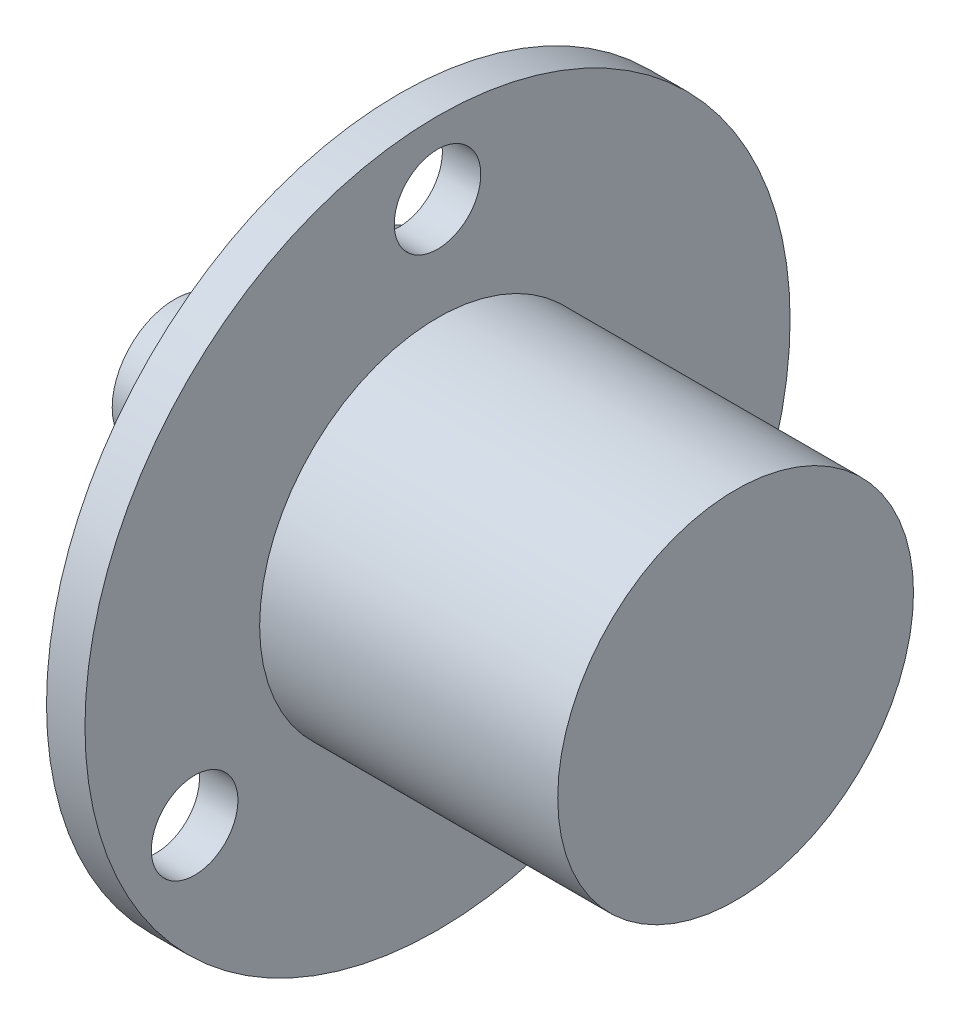
ISO-10303-21;
HEADER;
FILE_DESCRIPTION(('STEP AP214'),'2;1');
FILE_NAME('part.step','',(''),(''),'','','');
FILE_SCHEMA(('AUTOMOTIVE_DESIGN { 1 0 10303 214 1 1 1 1 }'));
ENDSEC;
DATA;
#1=APPLICATION_CONTEXT('core data for automotive mechanical design processes');
#2=APPLICATION_PROTOCOL_DEFINITION('international standard','automotive_design',2000,#1);
#3=PRODUCT_CONTEXT('',#1,'mechanical');
#4=PRODUCT('Part','Part','',(#3));
#5=PRODUCT_RELATED_PRODUCT_CATEGORY('part','',(#4));
#6=PRODUCT_DEFINITION_FORMATION('','',#4);
#7=PRODUCT_DEFINITION_CONTEXT('part definition',#1,'design');
#8=PRODUCT_DEFINITION('design','',#6,#7);
#9=PRODUCT_DEFINITION_SHAPE('','',#8);
#10=(LENGTH_UNIT() NAMED_UNIT(*) SI_UNIT(.MILLI.,.METRE.));
#11=(NAMED_UNIT(*) PLANE_ANGLE_UNIT() SI_UNIT($,.RADIAN.));
#12=(NAMED_UNIT(*) SI_UNIT($,.STERADIAN.) SOLID_ANGLE_UNIT());
#13=UNCERTAINTY_MEASURE_WITH_UNIT(LENGTH_MEASURE(1.E-05),#10,'distance_accuracy_value','');
#14=(GEOMETRIC_REPRESENTATION_CONTEXT(3) GLOBAL_UNCERTAINTY_ASSIGNED_CONTEXT((#13)) GLOBAL_UNIT_ASSIGNED_CONTEXT((#10,
#11,#12)) REPRESENTATION_CONTEXT('',''));
#15=CARTESIAN_POINT('',(0.,0.,0.));
#16=DIRECTION('',(0.,0.,1.));
#17=DIRECTION('',(1.,0.,0.));
#18=AXIS2_PLACEMENT_3D('',#15,#16,#17);
#19=CARTESIAN_POINT('',(0.,3.9,0.));
#20=DIRECTION('',(1.,0.,0.));
#21=DIRECTION('',(0.,0.,-1.));
#22=AXIS2_PLACEMENT_3D('',#19,#20,#21);
#23=PLANE('',#22);
#24=CARTESIAN_POINT('',(0.,0.,0.));
#25=DIRECTION('',(-1.,0.,0.));
#26=DIRECTION('',(0.,0.,1.));
#27=AXIS2_PLACEMENT_3D('',#24,#25,#26);
#28=CIRCLE('',#27,3.9);
#29=CARTESIAN_POINT('',(0.,0.,3.9));
#30=VERTEX_POINT('',#29);
#31=EDGE_CURVE('E59',#30,#30,#28,.T.);
#32=ORIENTED_EDGE('',*,*,#31,.T.);
#33=EDGE_LOOP('',(#32));
#34=FACE_BOUND('',#33,.T.);
#35=ADVANCED_FACE('F31',(#34),#23,.F.);
#36=CARTESIAN_POINT('',(35.,0.,0.));
#37=DIRECTION('',(-1.,0.,0.));
#38=DIRECTION('',(0.,0.,1.));
#39=AXIS2_PLACEMENT_3D('',#36,#37,#38);
#40=PLANE('',#39);
#41=CARTESIAN_POINT('',(35.,0.,0.));
#42=DIRECTION('',(-1.,0.,0.));
#43=DIRECTION('',(0.,0.,1.));
#44=AXIS2_PLACEMENT_3D('',#41,#42,#43);
#45=CIRCLE('',#44,11.1);
#46=CARTESIAN_POINT('',(35.,0.,11.1));
#47=VERTEX_POINT('',#46);
#48=EDGE_CURVE('E10',#47,#47,#45,.T.);
#49=ORIENTED_EDGE('',*,*,#48,.F.);
#50=EDGE_LOOP('',(#49));
#51=FACE_BOUND('',#50,.T.);
#52=ADVANCED_FACE('F111',(#51),#40,.F.);
#53=CARTESIAN_POINT('',(0.,0.,0.));
#54=DIRECTION('',(-1.,0.,0.));
#55=DIRECTION('',(0.,0.,1.));
#56=AXIS2_PLACEMENT_3D('',#53,#54,#55);
#57=CYLINDRICAL_SURFACE('',#56,11.1);
#58=CARTESIAN_POINT('',(16.4,0.,0.));
#59=DIRECTION('',(-1.,0.,0.));
#60=DIRECTION('',(0.,0.,1.));
#61=AXIS2_PLACEMENT_3D('',#58,#59,#60);
#62=CIRCLE('',#61,11.1);
#63=CARTESIAN_POINT('',(16.4,0.,11.1));
#64=VERTEX_POINT('',#63);
#65=EDGE_CURVE('E37',#64,#64,#62,.T.);
#66=ORIENTED_EDGE('',*,*,#65,.F.);
#67=EDGE_LOOP('',(#66));
#68=FACE_BOUND('',#67,.T.);
#69=ORIENTED_EDGE('',*,*,#48,.T.);
#70=EDGE_LOOP('',(#69));
#71=FACE_BOUND('',#70,.T.);
#72=ADVANCED_FACE('F105',(#68,#71),#57,.T.);
#73=CARTESIAN_POINT('',(16.4,11.1,0.));
#74=DIRECTION('',(-1.,0.,0.));
#75=DIRECTION('',(0.,0.,1.));
#76=AXIS2_PLACEMENT_3D('',#73,#74,#75);
#77=PLANE('',#76);
#78=CARTESIAN_POINT('',(16.4,17.5,0.));
#79=DIRECTION('',(-1.,0.,0.));
#80=DIRECTION('',(0.,0.,1.));
#81=AXIS2_PLACEMENT_3D('',#78,#79,#80);
#82=CIRCLE('',#81,2.7);
#83=CARTESIAN_POINT('',(16.4,17.5,2.7));
#84=VERTEX_POINT('',#83);
#85=EDGE_CURVE('E62',#84,#84,#82,.T.);
#86=ORIENTED_EDGE('',*,*,#85,.T.);
#87=EDGE_LOOP('',(#86));
#88=FACE_BOUND('',#87,.T.);
#89=CARTESIAN_POINT('',(16.4,-8.75,15.1554445662277));
#90=DIRECTION('',(-1.,0.,0.));
#91=DIRECTION('',(0.,0.,1.));
#92=AXIS2_PLACEMENT_3D('',#89,#90,#91);
#93=CIRCLE('',#92,2.7);
#94=CARTESIAN_POINT('',(16.4,-8.75,17.8554445662277));
#95=VERTEX_POINT('',#94);
#96=EDGE_CURVE('E65',#95,#95,#93,.T.);
#97=ORIENTED_EDGE('',*,*,#96,.T.);
#98=EDGE_LOOP('',(#97));
#99=FACE_BOUND('',#98,.T.);
#100=CARTESIAN_POINT('',(16.4,-8.75000000000001,-15.1554445662277));
#101=DIRECTION('',(-1.,0.,0.));
#102=DIRECTION('',(0.,0.,1.));
#103=AXIS2_PLACEMENT_3D('',#100,#101,#102);
#104=CIRCLE('',#103,2.7);
#105=CARTESIAN_POINT('',(16.4,-8.75000000000001,-12.4554445662277));
#106=VERTEX_POINT('',#105);
#107=EDGE_CURVE('E68',#106,#106,#104,.T.);
#108=ORIENTED_EDGE('',*,*,#107,.T.);
#109=EDGE_LOOP('',(#108));
#110=FACE_BOUND('',#109,.T.);
#111=CARTESIAN_POINT('',(16.4,0.,0.));
#112=DIRECTION('',(-1.,0.,0.));
#113=DIRECTION('',(0.,0.,1.));
#114=AXIS2_PLACEMENT_3D('',#111,#112,#113);
#115=CIRCLE('',#114,22.);
#116=CARTESIAN_POINT('',(16.4,0.,22.));
#117=VERTEX_POINT('',#116);
#118=EDGE_CURVE('E41',#117,#117,#115,.T.);
#119=ORIENTED_EDGE('',*,*,#118,.F.);
#120=EDGE_LOOP('',(#119));
#121=FACE_BOUND('',#120,.T.);
#122=ORIENTED_EDGE('',*,*,#65,.T.);
#123=EDGE_LOOP('',(#122));
#124=FACE_BOUND('',#123,.T.);
#125=ADVANCED_FACE('F100',(#88,#99,#110,#121,#124),#77,.F.);
#126=CARTESIAN_POINT('',(0.,0.,0.));
#127=DIRECTION('',(-1.,0.,0.));
#128=DIRECTION('',(0.,0.,1.));
#129=AXIS2_PLACEMENT_3D('',#126,#127,#128);
#130=CYLINDRICAL_SURFACE('',#129,22.);
#131=CARTESIAN_POINT('',(14.,0.,0.));
#132=DIRECTION('',(-1.,0.,0.));
#133=DIRECTION('',(0.,0.,1.));
#134=AXIS2_PLACEMENT_3D('',#131,#132,#133);
#135=CIRCLE('',#134,22.);
#136=CARTESIAN_POINT('',(14.,0.,22.));
#137=VERTEX_POINT('',#136);
#138=EDGE_CURVE('E45',#137,#137,#135,.T.);
#139=ORIENTED_EDGE('',*,*,#138,.F.);
#140=EDGE_LOOP('',(#139));
#141=FACE_BOUND('',#140,.T.);
#142=ORIENTED_EDGE('',*,*,#118,.T.);
#143=EDGE_LOOP('',(#142));
#144=FACE_BOUND('',#143,.T.);
#145=ADVANCED_FACE('F88',(#141,#144),#130,.T.);
#146=CARTESIAN_POINT('',(14.,22.,0.));
#147=DIRECTION('',(1.,0.,0.));
#148=DIRECTION('',(0.,0.,-1.));
#149=AXIS2_PLACEMENT_3D('',#146,#147,#148);
#150=PLANE('',#149);
#151=CARTESIAN_POINT('',(14.,17.5,0.));
#152=DIRECTION('',(-1.,0.,0.));
#153=DIRECTION('',(0.,0.,1.));
#154=AXIS2_PLACEMENT_3D('',#151,#152,#153);
#155=CIRCLE('',#154,2.7);
#156=CARTESIAN_POINT('',(14.,17.5,2.7));
#157=VERTEX_POINT('',#156);
#158=EDGE_CURVE('E71',#157,#157,#155,.T.);
#159=ORIENTED_EDGE('',*,*,#158,.F.);
#160=EDGE_LOOP('',(#159));
#161=FACE_BOUND('',#160,.T.);
#162=CARTESIAN_POINT('',(14.,-8.75,15.1554445662277));
#163=DIRECTION('',(-1.,0.,0.));
#164=DIRECTION('',(0.,0.,1.));
#165=AXIS2_PLACEMENT_3D('',#162,#163,#164);
#166=CIRCLE('',#165,2.7);
#167=CARTESIAN_POINT('',(14.,-8.75,17.8554445662277));
#168=VERTEX_POINT('',#167);
#169=EDGE_CURVE('E75',#168,#168,#166,.T.);
#170=ORIENTED_EDGE('',*,*,#169,.F.);
#171=EDGE_LOOP('',(#170));
#172=FACE_BOUND('',#171,.T.);
#173=CARTESIAN_POINT('',(14.,-8.75000000000001,-15.1554445662277));
#174=DIRECTION('',(-1.,0.,0.));
#175=DIRECTION('',(0.,0.,1.));
#176=AXIS2_PLACEMENT_3D('',#173,#174,#175);
#177=CIRCLE('',#176,2.7);
#178=CARTESIAN_POINT('',(14.,-8.75000000000001,-12.4554445662277));
#179=VERTEX_POINT('',#178);
#180=EDGE_CURVE('E72',#179,#179,#177,.T.);
#181=ORIENTED_EDGE('',*,*,#180,.F.);
#182=EDGE_LOOP('',(#181));
#183=FACE_BOUND('',#182,.T.);
#184=CARTESIAN_POINT('',(14.,0.,0.));
#185=DIRECTION('',(-1.,0.,0.));
#186=DIRECTION('',(0.,0.,1.));
#187=AXIS2_PLACEMENT_3D('',#184,#185,#186);
#188=CIRCLE('',#187,11.1);
#189=CARTESIAN_POINT('',(14.,0.,11.1));
#190=VERTEX_POINT('',#189);
#191=EDGE_CURVE('E50',#190,#190,#188,.T.);
#192=ORIENTED_EDGE('',*,*,#191,.F.);
#193=EDGE_LOOP('',(#192));
#194=FACE_BOUND('',#193,.T.);
#195=ORIENTED_EDGE('',*,*,#138,.T.);
#196=EDGE_LOOP('',(#195));
#197=FACE_BOUND('',#196,.T.);
#198=ADVANCED_FACE('F84',(#161,#172,#183,#194,#197),#150,.F.);
#199=CARTESIAN_POINT('',(0.,0.,0.));
#200=DIRECTION('',(-1.,0.,0.));
#201=DIRECTION('',(0.,0.,1.));
#202=AXIS2_PLACEMENT_3D('',#199,#200,#201);
#203=CYLINDRICAL_SURFACE('',#202,11.1);
#204=CARTESIAN_POINT('',(9.,0.,0.));
#205=DIRECTION('',(-1.,0.,0.));
#206=DIRECTION('',(0.,0.,1.));
#207=AXIS2_PLACEMENT_3D('',#204,#205,#206);
#208=CIRCLE('',#207,11.1);
#209=CARTESIAN_POINT('',(9.,0.,11.1));
#210=VERTEX_POINT('',#209);
#211=EDGE_CURVE('E53',#210,#210,#208,.T.);
#212=ORIENTED_EDGE('',*,*,#211,.F.);
#213=EDGE_LOOP('',(#212));
#214=FACE_BOUND('',#213,.T.);
#215=ORIENTED_EDGE('',*,*,#191,.T.);
#216=EDGE_LOOP('',(#215));
#217=FACE_BOUND('',#216,.T.);
#218=ADVANCED_FACE('F87',(#214,#217),#203,.T.);
#219=CARTESIAN_POINT('',(9.,11.1,0.));
#220=DIRECTION('',(1.,0.,0.));
#221=DIRECTION('',(0.,0.,-1.));
#222=AXIS2_PLACEMENT_3D('',#219,#220,#221);
#223=PLANE('',#222);
#224=CARTESIAN_POINT('',(9.,0.,0.));
#225=DIRECTION('',(-1.,0.,0.));
#226=DIRECTION('',(0.,0.,1.));
#227=AXIS2_PLACEMENT_3D('',#224,#225,#226);
#228=CIRCLE('',#227,3.9);
#229=CARTESIAN_POINT('',(9.,0.,3.9));
#230=VERTEX_POINT('',#229);
#231=EDGE_CURVE('E56',#230,#230,#228,.T.);
#232=ORIENTED_EDGE('',*,*,#231,.F.);
#233=EDGE_LOOP('',(#232));
#234=FACE_BOUND('',#233,.T.);
#235=ORIENTED_EDGE('',*,*,#211,.T.);
#236=EDGE_LOOP('',(#235));
#237=FACE_BOUND('',#236,.T.);
#238=ADVANCED_FACE('F127',(#234,#237),#223,.F.);
#239=CARTESIAN_POINT('',(0.,0.,0.));
#240=DIRECTION('',(-1.,0.,0.));
#241=DIRECTION('',(0.,0.,1.));
#242=AXIS2_PLACEMENT_3D('',#239,#240,#241);
#243=CYLINDRICAL_SURFACE('',#242,3.9);
#244=ORIENTED_EDGE('',*,*,#31,.F.);
#245=EDGE_LOOP('',(#244));
#246=FACE_BOUND('',#245,.T.);
#247=ORIENTED_EDGE('',*,*,#231,.T.);
#248=EDGE_LOOP('',(#247));
#249=FACE_BOUND('',#248,.T.);
#250=ADVANCED_FACE('F123',(#246,#249),#243,.T.);
#251=CARTESIAN_POINT('',(35.,-8.75000000000001,-15.1554445662277));
#252=DIRECTION('',(-1.,0.,0.));
#253=DIRECTION('',(0.,0.,1.));
#254=AXIS2_PLACEMENT_3D('',#251,#252,#253);
#255=CYLINDRICAL_SURFACE('',#254,2.7);
#256=ORIENTED_EDGE('',*,*,#180,.T.);
#257=EDGE_LOOP('',(#256));
#258=FACE_BOUND('',#257,.T.);
#259=ORIENTED_EDGE('',*,*,#107,.F.);
#260=EDGE_LOOP('',(#259));
#261=FACE_BOUND('',#260,.T.);
#262=ADVANCED_FACE('F126',(#258,#261),#255,.F.);
#263=CARTESIAN_POINT('',(35.,-8.75,15.1554445662277));
#264=DIRECTION('',(-1.,0.,0.));
#265=DIRECTION('',(0.,0.,1.));
#266=AXIS2_PLACEMENT_3D('',#263,#264,#265);
#267=CYLINDRICAL_SURFACE('',#266,2.7);
#268=ORIENTED_EDGE('',*,*,#169,.T.);
#269=EDGE_LOOP('',(#268));
#270=FACE_BOUND('',#269,.T.);
#271=ORIENTED_EDGE('',*,*,#96,.F.);
#272=EDGE_LOOP('',(#271));
#273=FACE_BOUND('',#272,.T.);
#274=ADVANCED_FACE('F144',(#270,#273),#267,.F.);
#275=CARTESIAN_POINT('',(35.,17.5,0.));
#276=DIRECTION('',(-1.,0.,0.));
#277=DIRECTION('',(0.,0.,1.));
#278=AXIS2_PLACEMENT_3D('',#275,#276,#277);
#279=CYLINDRICAL_SURFACE('',#278,2.7);
#280=ORIENTED_EDGE('',*,*,#158,.T.);
#281=EDGE_LOOP('',(#280));
#282=FACE_BOUND('',#281,.T.);
#283=ORIENTED_EDGE('',*,*,#85,.F.);
#284=EDGE_LOOP('',(#283));
#285=FACE_BOUND('',#284,.T.);
#286=ADVANCED_FACE('F81',(#282,#285),#279,.F.);
#287=CLOSED_SHELL('',(#35,#52,#72,#125,#145,#198,#218,#238,#250,#262,#274,#286));
#288=MANIFOLD_SOLID_BREP('B2',#287);
#289=ADVANCED_BREP_SHAPE_REPRESENTATION('',(#18,#288),#14);
#290=SHAPE_DEFINITION_REPRESENTATION(#9,#289);
ENDSEC;
END-ISO-10303-21;
